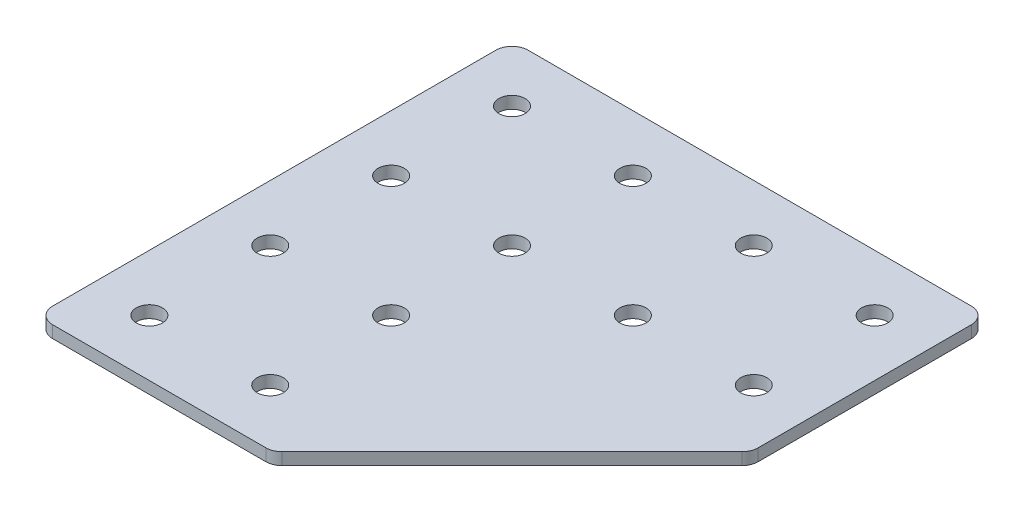
ISO-10303-21;
HEADER;
FILE_DESCRIPTION(('STEP AP214'),'2;1');
FILE_NAME('part.step','',(''),(''),'','','');
FILE_SCHEMA(('AUTOMOTIVE_DESIGN { 1 0 10303 214 1 1 1 1 }'));
ENDSEC;
DATA;
#1=APPLICATION_CONTEXT('core data for automotive mechanical design processes');
#2=APPLICATION_PROTOCOL_DEFINITION('international standard','automotive_design',2000,#1);
#3=PRODUCT_CONTEXT('',#1,'mechanical');
#4=PRODUCT('Part','Part','',(#3));
#5=PRODUCT_RELATED_PRODUCT_CATEGORY('part','',(#4));
#6=PRODUCT_DEFINITION_FORMATION('','',#4);
#7=PRODUCT_DEFINITION_CONTEXT('part definition',#1,'design');
#8=PRODUCT_DEFINITION('design','',#6,#7);
#9=PRODUCT_DEFINITION_SHAPE('','',#8);
#10=(LENGTH_UNIT() NAMED_UNIT(*) SI_UNIT(.MILLI.,.METRE.));
#11=(NAMED_UNIT(*) PLANE_ANGLE_UNIT() SI_UNIT($,.RADIAN.));
#12=(NAMED_UNIT(*) SI_UNIT($,.STERADIAN.) SOLID_ANGLE_UNIT());
#13=UNCERTAINTY_MEASURE_WITH_UNIT(LENGTH_MEASURE(1.E-05),#10,'distance_accuracy_value','');
#14=(GEOMETRIC_REPRESENTATION_CONTEXT(3) GLOBAL_UNCERTAINTY_ASSIGNED_CONTEXT((#13)) GLOBAL_UNIT_ASSIGNED_CONTEXT((#10,
#11,#12)) REPRESENTATION_CONTEXT('',''));
#15=CARTESIAN_POINT('',(0.,0.,0.));
#16=DIRECTION('',(0.,0.,1.));
#17=DIRECTION('',(1.,0.,0.));
#18=AXIS2_PLACEMENT_3D('',#15,#16,#17);
#19=CARTESIAN_POINT('',(-15.9700014306304,1.74134831022957,-16.520941998649));
#20=DIRECTION('',(0.,-1.,0.));
#21=DIRECTION('',(0.,0.,-1.));
#22=AXIS2_PLACEMENT_3D('',#19,#20,#21);
#23=PLANE('',#22);
#24=CARTESIAN_POINT('',(21.5299985693696,1.74134831022957,-9.02094199864901));
#25=DIRECTION('',(0.,1.,0.));
#26=DIRECTION('',(0.,0.,1.));
#27=AXIS2_PLACEMENT_3D('',#24,#25,#26);
#28=CIRCLE('',#27,1.625);
#29=CARTESIAN_POINT('',(21.5299985693696,1.74134831022957,-7.39594199864901));
#30=VERTEX_POINT('',#29);
#31=EDGE_CURVE('E252',#30,#30,#28,.T.);
#32=ORIENTED_EDGE('',*,*,#31,.T.);
#33=EDGE_LOOP('',(#32));
#34=FACE_BOUND('',#33,.T.);
#35=CARTESIAN_POINT('',(6.52999856936955,1.74134831022957,-9.020941998649));
#36=DIRECTION('',(0.,1.,0.));
#37=DIRECTION('',(0.,0.,1.));
#38=AXIS2_PLACEMENT_3D('',#35,#36,#37);
#39=CIRCLE('',#38,1.625);
#40=CARTESIAN_POINT('',(6.52999856936955,1.74134831022957,-7.395941998649));
#41=VERTEX_POINT('',#40);
#42=EDGE_CURVE('E246',#41,#41,#39,.T.);
#43=ORIENTED_EDGE('',*,*,#42,.T.);
#44=EDGE_LOOP('',(#43));
#45=FACE_BOUND('',#44,.T.);
#46=CARTESIAN_POINT('',(-8.47000143063042,1.74134831022957,20.979058001351));
#47=DIRECTION('',(0.,1.,0.));
#48=DIRECTION('',(0.,0.,1.));
#49=AXIS2_PLACEMENT_3D('',#46,#47,#48);
#50=CIRCLE('',#49,1.625);
#51=CARTESIAN_POINT('',(-8.47000143063042,1.74134831022957,22.604058001351));
#52=VERTEX_POINT('',#51);
#53=EDGE_CURVE('E240',#52,#52,#50,.T.);
#54=ORIENTED_EDGE('',*,*,#53,.T.);
#55=EDGE_LOOP('',(#54));
#56=FACE_BOUND('',#55,.T.);
#57=CARTESIAN_POINT('',(-23.4700014306304,1.74134831022957,20.979058001351));
#58=DIRECTION('',(0.,1.,0.));
#59=DIRECTION('',(0.,0.,1.));
#60=AXIS2_PLACEMENT_3D('',#57,#58,#59);
#61=CIRCLE('',#60,1.625);
#62=CARTESIAN_POINT('',(-23.4700014306304,1.74134831022957,22.604058001351));
#63=VERTEX_POINT('',#62);
#64=EDGE_CURVE('E234',#63,#63,#61,.T.);
#65=ORIENTED_EDGE('',*,*,#64,.T.);
#66=EDGE_LOOP('',(#65));
#67=FACE_BOUND('',#66,.T.);
#68=CARTESIAN_POINT('',(-8.47000143063041,1.74134831022957,5.97905800135099));
#69=DIRECTION('',(0.,1.,0.));
#70=DIRECTION('',(0.,0.,1.));
#71=AXIS2_PLACEMENT_3D('',#68,#69,#70);
#72=CIRCLE('',#71,1.625);
#73=CARTESIAN_POINT('',(-8.47000143063041,1.74134831022957,7.60405800135099));
#74=VERTEX_POINT('',#73);
#75=EDGE_CURVE('E228',#74,#74,#72,.T.);
#76=ORIENTED_EDGE('',*,*,#75,.T.);
#77=EDGE_LOOP('',(#76));
#78=FACE_BOUND('',#77,.T.);
#79=CARTESIAN_POINT('',(-23.4700014306304,1.74134831022957,5.97905800135099));
#80=DIRECTION('',(0.,1.,0.));
#81=DIRECTION('',(0.,0.,1.));
#82=AXIS2_PLACEMENT_3D('',#79,#80,#81);
#83=CIRCLE('',#82,1.625);
#84=CARTESIAN_POINT('',(-23.4700014306304,1.74134831022957,7.60405800135099));
#85=VERTEX_POINT('',#84);
#86=EDGE_CURVE('E222',#85,#85,#83,.T.);
#87=ORIENTED_EDGE('',*,*,#86,.T.);
#88=EDGE_LOOP('',(#87));
#89=FACE_BOUND('',#88,.T.);
#90=CARTESIAN_POINT('',(-8.47000143063044,1.74134831022957,-9.020941998649));
#91=DIRECTION('',(0.,1.,0.));
#92=DIRECTION('',(0.,0.,1.));
#93=AXIS2_PLACEMENT_3D('',#90,#91,#92);
#94=CIRCLE('',#93,1.625);
#95=CARTESIAN_POINT('',(-8.47000143063044,1.74134831022957,-7.395941998649));
#96=VERTEX_POINT('',#95);
#97=EDGE_CURVE('E216',#96,#96,#94,.T.);
#98=ORIENTED_EDGE('',*,*,#97,.T.);
#99=EDGE_LOOP('',(#98));
#100=FACE_BOUND('',#99,.T.);
#101=CARTESIAN_POINT('',(-23.4700014306304,1.74134831022957,-9.02094199864902));
#102=DIRECTION('',(0.,1.,0.));
#103=DIRECTION('',(0.,0.,1.));
#104=AXIS2_PLACEMENT_3D('',#101,#102,#103);
#105=CIRCLE('',#104,1.625);
#106=CARTESIAN_POINT('',(-23.4700014306304,1.74134831022957,-7.39594199864902));
#107=VERTEX_POINT('',#106);
#108=EDGE_CURVE('E210',#107,#107,#105,.T.);
#109=ORIENTED_EDGE('',*,*,#108,.T.);
#110=EDGE_LOOP('',(#109));
#111=FACE_BOUND('',#110,.T.);
#112=CARTESIAN_POINT('',(21.5299985693696,1.74134831022957,-24.020941998649));
#113=DIRECTION('',(0.,1.,0.));
#114=DIRECTION('',(0.,0.,1.));
#115=AXIS2_PLACEMENT_3D('',#112,#113,#114);
#116=CIRCLE('',#115,1.625);
#117=CARTESIAN_POINT('',(21.5299985693696,1.74134831022957,-22.395941998649));
#118=VERTEX_POINT('',#117);
#119=EDGE_CURVE('E204',#118,#118,#116,.T.);
#120=ORIENTED_EDGE('',*,*,#119,.T.);
#121=EDGE_LOOP('',(#120));
#122=FACE_BOUND('',#121,.T.);
#123=CARTESIAN_POINT('',(6.52999856936955,1.74134831022957,-24.020941998649));
#124=DIRECTION('',(0.,1.,0.));
#125=DIRECTION('',(0.,0.,1.));
#126=AXIS2_PLACEMENT_3D('',#123,#124,#125);
#127=CIRCLE('',#126,1.625);
#128=CARTESIAN_POINT('',(6.52999856936955,1.74134831022957,-22.395941998649));
#129=VERTEX_POINT('',#128);
#130=EDGE_CURVE('E198',#129,#129,#127,.T.);
#131=ORIENTED_EDGE('',*,*,#130,.T.);
#132=EDGE_LOOP('',(#131));
#133=FACE_BOUND('',#132,.T.);
#134=CARTESIAN_POINT('',(-8.47000143063044,1.74134831022957,-24.020941998649));
#135=DIRECTION('',(0.,1.,0.));
#136=DIRECTION('',(0.,0.,1.));
#137=AXIS2_PLACEMENT_3D('',#134,#135,#136);
#138=CIRCLE('',#137,1.625);
#139=CARTESIAN_POINT('',(-8.47000143063044,1.74134831022957,-22.395941998649));
#140=VERTEX_POINT('',#139);
#141=EDGE_CURVE('E192',#140,#140,#138,.T.);
#142=ORIENTED_EDGE('',*,*,#141,.T.);
#143=EDGE_LOOP('',(#142));
#144=FACE_BOUND('',#143,.T.);
#145=CARTESIAN_POINT('',(-23.4700014306304,1.74134831022957,-24.020941998649));
#146=DIRECTION('',(0.,1.,0.));
#147=DIRECTION('',(0.,0.,1.));
#148=AXIS2_PLACEMENT_3D('',#145,#146,#147);
#149=CIRCLE('',#148,1.625);
#150=CARTESIAN_POINT('',(-23.4700014306304,1.74134831022957,-22.395941998649));
#151=VERTEX_POINT('',#150);
#152=EDGE_CURVE('E167',#151,#151,#149,.T.);
#153=ORIENTED_EDGE('',*,*,#152,.T.);
#154=EDGE_LOOP('',(#153));
#155=FACE_BOUND('',#154,.T.);
#156=DIRECTION('',(0.707106781186548,0.,-0.707106781186547));
#157=VECTOR('',#156,1.);
#158=CARTESIAN_POINT('',(-1.17710821181696,1.74134831022957,27.9790580013509));
#159=LINE('',#158,#157);
#160=CARTESIAN_POINT('',(-0.591321774190058,1.74134831022957,27.393271563724));
#161=VERTEX_POINT('',#160);
#162=CARTESIAN_POINT('',(27.9442121317427,1.74134831022957,-1.14226234220862));
#163=VERTEX_POINT('',#162);
#164=EDGE_CURVE('E115',#161,#163,#159,.T.);
#165=ORIENTED_EDGE('',*,*,#164,.F.);
#166=CARTESIAN_POINT('',(-2.00553533656315,1.74134831022957,25.9790580013509));
#167=DIRECTION('',(0.,-1.,0.));
#168=DIRECTION('',(0.,0.,-1.));
#169=AXIS2_PLACEMENT_3D('',#166,#167,#168);
#170=CIRCLE('',#169,2.);
#171=CARTESIAN_POINT('',(-2.00553533656315,1.74134831022957,27.9790580013509));
#172=VERTEX_POINT('',#171);
#173=EDGE_CURVE('E141',#161,#172,#170,.T.);
#174=ORIENTED_EDGE('',*,*,#173,.T.);
#175=DIRECTION('',(1.,0.,0.));
#176=VECTOR('',#175,1.);
#177=CARTESIAN_POINT('',(-30.4700014306304,1.74134831022957,27.9790580013509));
#178=LINE('',#177,#176);
#179=CARTESIAN_POINT('',(-28.4700014306304,1.74134831022957,27.9790580013509));
#180=VERTEX_POINT('',#179);
#181=EDGE_CURVE('E119',#180,#172,#178,.T.);
#182=ORIENTED_EDGE('',*,*,#181,.F.);
#183=CARTESIAN_POINT('',(-28.4700014306304,1.74134831022957,25.9790580013509));
#184=DIRECTION('',(0.,-1.,0.));
#185=DIRECTION('',(0.,0.,-1.));
#186=AXIS2_PLACEMENT_3D('',#183,#184,#185);
#187=CIRCLE('',#186,2.);
#188=CARTESIAN_POINT('',(-30.4700014306304,1.74134831022957,25.9790580013509));
#189=VERTEX_POINT('',#188);
#190=EDGE_CURVE('E31',#180,#189,#187,.T.);
#191=ORIENTED_EDGE('',*,*,#190,.T.);
#192=DIRECTION('',(0.,0.,1.));
#193=VECTOR('',#192,1.);
#194=CARTESIAN_POINT('',(-30.4700014306304,1.74134831022957,-31.0209419986491));
#195=LINE('',#194,#193);
#196=CARTESIAN_POINT('',(-30.4700014306304,1.74134831022957,-29.0209419986491));
#197=VERTEX_POINT('',#196);
#198=EDGE_CURVE('E153',#197,#189,#195,.T.);
#199=ORIENTED_EDGE('',*,*,#198,.F.);
#200=CARTESIAN_POINT('',(-28.4700014306304,1.74134831022957,-29.0209419986491));
#201=DIRECTION('',(0.,-1.,0.));
#202=DIRECTION('',(0.,0.,-1.));
#203=AXIS2_PLACEMENT_3D('',#200,#201,#202);
#204=CIRCLE('',#203,2.);
#205=CARTESIAN_POINT('',(-28.4700014306304,1.74134831022957,-31.0209419986491));
#206=VERTEX_POINT('',#205);
#207=EDGE_CURVE('E137',#197,#206,#204,.T.);
#208=ORIENTED_EDGE('',*,*,#207,.T.);
#209=DIRECTION('',(-1.,0.,0.));
#210=VECTOR('',#209,1.);
#211=CARTESIAN_POINT('',(28.5299985693696,1.74134831022957,-31.0209419986491));
#212=LINE('',#211,#210);
#213=CARTESIAN_POINT('',(26.5299985693696,1.74134831022957,-31.0209419986491));
#214=VERTEX_POINT('',#213);
#215=EDGE_CURVE('E155',#214,#206,#212,.T.);
#216=ORIENTED_EDGE('',*,*,#215,.F.);
#217=CARTESIAN_POINT('',(26.5299985693696,1.74134831022957,-29.020941998649));
#218=DIRECTION('',(0.,-1.,0.));
#219=DIRECTION('',(0.,0.,-1.));
#220=AXIS2_PLACEMENT_3D('',#217,#218,#219);
#221=CIRCLE('',#220,2.);
#222=CARTESIAN_POINT('',(28.5299985693696,1.74134831022957,-29.020941998649));
#223=VERTEX_POINT('',#222);
#224=EDGE_CURVE('E134',#214,#223,#221,.T.);
#225=ORIENTED_EDGE('',*,*,#224,.T.);
#226=DIRECTION('',(0.,0.,-1.));
#227=VECTOR('',#226,1.);
#228=CARTESIAN_POINT('',(28.5299985693696,1.74134831022957,-1.72804877983552));
#229=LINE('',#228,#227);
#230=CARTESIAN_POINT('',(28.5299985693696,1.74134831022957,-2.55647590458171));
#231=VERTEX_POINT('',#230);
#232=EDGE_CURVE('E159',#231,#223,#229,.T.);
#233=ORIENTED_EDGE('',*,*,#232,.F.);
#234=CARTESIAN_POINT('',(26.5299985693696,1.74134831022957,-2.55647590458171));
#235=DIRECTION('',(0.,-1.,0.));
#236=DIRECTION('',(0.,0.,-1.));
#237=AXIS2_PLACEMENT_3D('',#234,#235,#236);
#238=CIRCLE('',#237,2.);
#239=EDGE_CURVE('E139',#231,#163,#238,.T.);
#240=ORIENTED_EDGE('',*,*,#239,.T.);
#241=EDGE_LOOP('',(#165,#174,#182,#191,#199,#208,#216,#225,#233,#240));
#242=FACE_BOUND('',#241,.T.);
#243=ADVANCED_FACE('F16',(#34,#45,#56,#67,#78,#89,#100,#111,#122,#133,#144,#155,#242),#23,.T.);
#244=CARTESIAN_POINT('',(28.5299985693696,1.74134831022957,-1.72804877983552));
#245=DIRECTION('',(1.,0.,0.));
#246=DIRECTION('',(0.,0.,-1.));
#247=AXIS2_PLACEMENT_3D('',#244,#245,#246);
#248=PLANE('',#247);
#249=DIRECTION('',(0.,0.,-1.));
#250=VECTOR('',#249,1.);
#251=CARTESIAN_POINT('',(28.5299985693696,3.24134831022957,-1.72804877983552));
#252=LINE('',#251,#250);
#253=CARTESIAN_POINT('',(28.5299985693696,3.24134831022957,-2.55647590458171));
#254=VERTEX_POINT('',#253);
#255=CARTESIAN_POINT('',(28.5299985693696,3.24134831022957,-29.020941998649));
#256=VERTEX_POINT('',#255);
#257=EDGE_CURVE('E163',#254,#256,#252,.T.);
#258=ORIENTED_EDGE('',*,*,#257,.F.);
#259=DIRECTION('',(0.,1.,0.));
#260=VECTOR('',#259,1.);
#261=CARTESIAN_POINT('',(28.5299985693696,1.74134831022957,-2.55647590458171));
#262=LINE('',#261,#260);
#263=EDGE_CURVE('E146',#254,#231,#262,.F.);
#264=ORIENTED_EDGE('',*,*,#263,.T.);
#265=ORIENTED_EDGE('',*,*,#232,.T.);
#266=DIRECTION('',(0.,1.,0.));
#267=VECTOR('',#266,1.);
#268=CARTESIAN_POINT('',(28.5299985693696,1.74134831022957,-29.020941998649));
#269=LINE('',#268,#267);
#270=EDGE_CURVE('E143',#223,#256,#269,.T.);
#271=ORIENTED_EDGE('',*,*,#270,.T.);
#272=EDGE_LOOP('',(#258,#264,#265,#271));
#273=FACE_BOUND('',#272,.T.);
#274=ADVANCED_FACE('F185',(#273),#248,.T.);
#275=CARTESIAN_POINT('',(-1.17710821181696,1.74134831022957,27.9790580013509));
#276=DIRECTION('',(0.707106781186547,0.,0.707106781186548));
#277=DIRECTION('',(0.707106781186548,0.,-0.707106781186547));
#278=AXIS2_PLACEMENT_3D('',#275,#276,#277);
#279=PLANE('',#278);
#280=DIRECTION('',(0.707106781186548,0.,-0.707106781186547));
#281=VECTOR('',#280,1.);
#282=CARTESIAN_POINT('',(-1.17710821181696,3.24134831022957,27.9790580013509));
#283=LINE('',#282,#281);
#284=CARTESIAN_POINT('',(-0.591321774190058,3.24134831022957,27.393271563724));
#285=VERTEX_POINT('',#284);
#286=CARTESIAN_POINT('',(27.9442121317427,3.24134831022957,-1.14226234220862));
#287=VERTEX_POINT('',#286);
#288=EDGE_CURVE('E112',#285,#287,#283,.T.);
#289=ORIENTED_EDGE('',*,*,#288,.F.);
#290=DIRECTION('',(0.,1.,0.));
#291=VECTOR('',#290,1.);
#292=CARTESIAN_POINT('',(-0.59132177419006,1.74134831022957,27.393271563724));
#293=LINE('',#292,#291);
#294=EDGE_CURVE('E132',#285,#161,#293,.F.);
#295=ORIENTED_EDGE('',*,*,#294,.T.);
#296=ORIENTED_EDGE('',*,*,#164,.T.);
#297=DIRECTION('',(0.,1.,0.));
#298=VECTOR('',#297,1.);
#299=CARTESIAN_POINT('',(27.9442121317427,1.74134831022957,-1.14226234220861));
#300=LINE('',#299,#298);
#301=EDGE_CURVE('E129',#163,#287,#300,.T.);
#302=ORIENTED_EDGE('',*,*,#301,.T.);
#303=EDGE_LOOP('',(#289,#295,#296,#302));
#304=FACE_BOUND('',#303,.T.);
#305=ADVANCED_FACE('F315',(#304),#279,.T.);
#306=CARTESIAN_POINT('',(-30.4700014306304,1.74134831022957,27.9790580013509));
#307=DIRECTION('',(0.,0.,1.));
#308=DIRECTION('',(1.,0.,0.));
#309=AXIS2_PLACEMENT_3D('',#306,#307,#308);
#310=PLANE('',#309);
#311=ORIENTED_EDGE('',*,*,#181,.T.);
#312=DIRECTION('',(0.,1.,0.));
#313=VECTOR('',#312,1.);
#314=CARTESIAN_POINT('',(-2.00553533656315,1.74134831022957,27.9790580013509));
#315=LINE('',#314,#313);
#316=CARTESIAN_POINT('',(-2.00553533656315,3.24134831022957,27.9790580013509));
#317=VERTEX_POINT('',#316);
#318=EDGE_CURVE('E111',#172,#317,#315,.T.);
#319=ORIENTED_EDGE('',*,*,#318,.T.);
#320=DIRECTION('',(1.,0.,0.));
#321=VECTOR('',#320,1.);
#322=CARTESIAN_POINT('',(-30.4700014306304,3.24134831022957,27.9790580013509));
#323=LINE('',#322,#321);
#324=CARTESIAN_POINT('',(-28.4700014306304,3.24134831022957,27.9790580013509));
#325=VERTEX_POINT('',#324);
#326=EDGE_CURVE('E96',#325,#317,#323,.T.);
#327=ORIENTED_EDGE('',*,*,#326,.F.);
#328=DIRECTION('',(0.,1.,0.));
#329=VECTOR('',#328,1.);
#330=CARTESIAN_POINT('',(-28.4700014306304,1.74134831022957,27.9790580013509));
#331=LINE('',#330,#329);
#332=EDGE_CURVE('E109',#325,#180,#331,.F.);
#333=ORIENTED_EDGE('',*,*,#332,.T.);
#334=EDGE_LOOP('',(#311,#319,#327,#333));
#335=FACE_BOUND('',#334,.T.);
#336=ADVANCED_FACE('F108',(#335),#310,.T.);
#337=CARTESIAN_POINT('',(-30.4700014306304,1.74134831022957,-31.0209419986491));
#338=DIRECTION('',(-1.,0.,0.));
#339=DIRECTION('',(0.,0.,1.));
#340=AXIS2_PLACEMENT_3D('',#337,#338,#339);
#341=PLANE('',#340);
#342=DIRECTION('',(0.,0.,1.));
#343=VECTOR('',#342,1.);
#344=CARTESIAN_POINT('',(-30.4700014306304,3.24134831022957,-31.0209419986491));
#345=LINE('',#344,#343);
#346=CARTESIAN_POINT('',(-30.4700014306304,3.24134831022957,-29.0209419986491));
#347=VERTEX_POINT('',#346);
#348=CARTESIAN_POINT('',(-30.4700014306304,3.24134831022957,25.9790580013509));
#349=VERTEX_POINT('',#348);
#350=EDGE_CURVE('E97',#347,#349,#345,.T.);
#351=ORIENTED_EDGE('',*,*,#350,.F.);
#352=DIRECTION('',(0.,1.,0.));
#353=VECTOR('',#352,1.);
#354=CARTESIAN_POINT('',(-30.4700014306304,1.74134831022957,-29.0209419986491));
#355=LINE('',#354,#353);
#356=EDGE_CURVE('E10',#347,#197,#355,.F.);
#357=ORIENTED_EDGE('',*,*,#356,.T.);
#358=ORIENTED_EDGE('',*,*,#198,.T.);
#359=DIRECTION('',(0.,1.,0.));
#360=VECTOR('',#359,1.);
#361=CARTESIAN_POINT('',(-30.4700014306304,1.74134831022957,25.9790580013509));
#362=LINE('',#361,#360);
#363=EDGE_CURVE('E24',#189,#349,#362,.T.);
#364=ORIENTED_EDGE('',*,*,#363,.T.);
#365=EDGE_LOOP('',(#351,#357,#358,#364));
#366=FACE_BOUND('',#365,.T.);
#367=ADVANCED_FACE('F152',(#366),#341,.T.);
#368=CARTESIAN_POINT('',(28.5299985693696,1.74134831022957,-31.0209419986491));
#369=DIRECTION('',(0.,0.,-1.));
#370=DIRECTION('',(-1.,0.,0.));
#371=AXIS2_PLACEMENT_3D('',#368,#369,#370);
#372=PLANE('',#371);
#373=ORIENTED_EDGE('',*,*,#215,.T.);
#374=DIRECTION('',(0.,1.,0.));
#375=VECTOR('',#374,1.);
#376=CARTESIAN_POINT('',(-28.4700014306304,1.74134831022957,-31.0209419986491));
#377=LINE('',#376,#375);
#378=CARTESIAN_POINT('',(-28.4700014306304,3.24134831022957,-31.0209419986491));
#379=VERTEX_POINT('',#378);
#380=EDGE_CURVE('E150',#206,#379,#377,.T.);
#381=ORIENTED_EDGE('',*,*,#380,.T.);
#382=DIRECTION('',(-1.,0.,0.));
#383=VECTOR('',#382,1.);
#384=CARTESIAN_POINT('',(28.5299985693696,3.24134831022957,-31.0209419986491));
#385=LINE('',#384,#383);
#386=CARTESIAN_POINT('',(26.5299985693696,3.24134831022957,-31.0209419986491));
#387=VERTEX_POINT('',#386);
#388=EDGE_CURVE('E166',#387,#379,#385,.T.);
#389=ORIENTED_EDGE('',*,*,#388,.F.);
#390=DIRECTION('',(0.,1.,0.));
#391=VECTOR('',#390,1.);
#392=CARTESIAN_POINT('',(26.5299985693696,1.74134831022957,-31.0209419986491));
#393=LINE('',#392,#391);
#394=EDGE_CURVE('E148',#387,#214,#393,.F.);
#395=ORIENTED_EDGE('',*,*,#394,.T.);
#396=EDGE_LOOP('',(#373,#381,#389,#395));
#397=FACE_BOUND('',#396,.T.);
#398=ADVANCED_FACE('F173',(#397),#372,.T.);
#399=CARTESIAN_POINT('',(-15.9700014306304,3.24134831022957,-16.520941998649));
#400=DIRECTION('',(0.,-1.,0.));
#401=DIRECTION('',(0.,0.,-1.));
#402=AXIS2_PLACEMENT_3D('',#399,#400,#401);
#403=PLANE('',#402);
#404=CARTESIAN_POINT('',(21.5299985693696,3.24134831022957,-9.02094199864901));
#405=DIRECTION('',(0.,1.,0.));
#406=DIRECTION('',(0.,0.,1.));
#407=AXIS2_PLACEMENT_3D('',#404,#405,#406);
#408=CIRCLE('',#407,1.625);
#409=CARTESIAN_POINT('',(21.5299985693696,3.24134831022957,-7.39594199864901));
#410=VERTEX_POINT('',#409);
#411=EDGE_CURVE('E255',#410,#410,#408,.T.);
#412=ORIENTED_EDGE('',*,*,#411,.F.);
#413=EDGE_LOOP('',(#412));
#414=FACE_BOUND('',#413,.T.);
#415=CARTESIAN_POINT('',(6.52999856936955,3.24134831022957,-9.020941998649));
#416=DIRECTION('',(0.,1.,0.));
#417=DIRECTION('',(0.,0.,1.));
#418=AXIS2_PLACEMENT_3D('',#415,#416,#417);
#419=CIRCLE('',#418,1.625);
#420=CARTESIAN_POINT('',(6.52999856936955,3.24134831022957,-7.395941998649));
#421=VERTEX_POINT('',#420);
#422=EDGE_CURVE('E249',#421,#421,#419,.T.);
#423=ORIENTED_EDGE('',*,*,#422,.F.);
#424=EDGE_LOOP('',(#423));
#425=FACE_BOUND('',#424,.T.);
#426=CARTESIAN_POINT('',(-8.47000143063042,3.24134831022957,20.979058001351));
#427=DIRECTION('',(0.,1.,0.));
#428=DIRECTION('',(0.,0.,1.));
#429=AXIS2_PLACEMENT_3D('',#426,#427,#428);
#430=CIRCLE('',#429,1.625);
#431=CARTESIAN_POINT('',(-8.47000143063042,3.24134831022957,22.604058001351));
#432=VERTEX_POINT('',#431);
#433=EDGE_CURVE('E243',#432,#432,#430,.T.);
#434=ORIENTED_EDGE('',*,*,#433,.F.);
#435=EDGE_LOOP('',(#434));
#436=FACE_BOUND('',#435,.T.);
#437=CARTESIAN_POINT('',(-23.4700014306304,3.24134831022957,20.979058001351));
#438=DIRECTION('',(0.,1.,0.));
#439=DIRECTION('',(0.,0.,1.));
#440=AXIS2_PLACEMENT_3D('',#437,#438,#439);
#441=CIRCLE('',#440,1.625);
#442=CARTESIAN_POINT('',(-23.4700014306304,3.24134831022957,22.604058001351));
#443=VERTEX_POINT('',#442);
#444=EDGE_CURVE('E237',#443,#443,#441,.T.);
#445=ORIENTED_EDGE('',*,*,#444,.F.);
#446=EDGE_LOOP('',(#445));
#447=FACE_BOUND('',#446,.T.);
#448=CARTESIAN_POINT('',(-8.47000143063041,3.24134831022957,5.97905800135099));
#449=DIRECTION('',(0.,1.,0.));
#450=DIRECTION('',(0.,0.,1.));
#451=AXIS2_PLACEMENT_3D('',#448,#449,#450);
#452=CIRCLE('',#451,1.625);
#453=CARTESIAN_POINT('',(-8.47000143063041,3.24134831022957,7.60405800135099));
#454=VERTEX_POINT('',#453);
#455=EDGE_CURVE('E231',#454,#454,#452,.T.);
#456=ORIENTED_EDGE('',*,*,#455,.F.);
#457=EDGE_LOOP('',(#456));
#458=FACE_BOUND('',#457,.T.);
#459=CARTESIAN_POINT('',(-23.4700014306304,3.24134831022957,5.97905800135099));
#460=DIRECTION('',(0.,1.,0.));
#461=DIRECTION('',(0.,0.,1.));
#462=AXIS2_PLACEMENT_3D('',#459,#460,#461);
#463=CIRCLE('',#462,1.625);
#464=CARTESIAN_POINT('',(-23.4700014306304,3.24134831022957,7.60405800135099));
#465=VERTEX_POINT('',#464);
#466=EDGE_CURVE('E225',#465,#465,#463,.T.);
#467=ORIENTED_EDGE('',*,*,#466,.F.);
#468=EDGE_LOOP('',(#467));
#469=FACE_BOUND('',#468,.T.);
#470=CARTESIAN_POINT('',(-8.47000143063044,3.24134831022957,-9.020941998649));
#471=DIRECTION('',(0.,1.,0.));
#472=DIRECTION('',(0.,0.,1.));
#473=AXIS2_PLACEMENT_3D('',#470,#471,#472);
#474=CIRCLE('',#473,1.625);
#475=CARTESIAN_POINT('',(-8.47000143063044,3.24134831022957,-7.395941998649));
#476=VERTEX_POINT('',#475);
#477=EDGE_CURVE('E219',#476,#476,#474,.T.);
#478=ORIENTED_EDGE('',*,*,#477,.F.);
#479=EDGE_LOOP('',(#478));
#480=FACE_BOUND('',#479,.T.);
#481=CARTESIAN_POINT('',(-23.4700014306304,3.24134831022957,-9.02094199864902));
#482=DIRECTION('',(0.,1.,0.));
#483=DIRECTION('',(0.,0.,1.));
#484=AXIS2_PLACEMENT_3D('',#481,#482,#483);
#485=CIRCLE('',#484,1.625);
#486=CARTESIAN_POINT('',(-23.4700014306304,3.24134831022957,-7.39594199864902));
#487=VERTEX_POINT('',#486);
#488=EDGE_CURVE('E213',#487,#487,#485,.T.);
#489=ORIENTED_EDGE('',*,*,#488,.F.);
#490=EDGE_LOOP('',(#489));
#491=FACE_BOUND('',#490,.T.);
#492=CARTESIAN_POINT('',(21.5299985693696,3.24134831022957,-24.020941998649));
#493=DIRECTION('',(0.,1.,0.));
#494=DIRECTION('',(0.,0.,1.));
#495=AXIS2_PLACEMENT_3D('',#492,#493,#494);
#496=CIRCLE('',#495,1.625);
#497=CARTESIAN_POINT('',(21.5299985693696,3.24134831022957,-22.395941998649));
#498=VERTEX_POINT('',#497);
#499=EDGE_CURVE('E207',#498,#498,#496,.T.);
#500=ORIENTED_EDGE('',*,*,#499,.F.);
#501=EDGE_LOOP('',(#500));
#502=FACE_BOUND('',#501,.T.);
#503=CARTESIAN_POINT('',(6.52999856936955,3.24134831022957,-24.020941998649));
#504=DIRECTION('',(0.,1.,0.));
#505=DIRECTION('',(0.,0.,1.));
#506=AXIS2_PLACEMENT_3D('',#503,#504,#505);
#507=CIRCLE('',#506,1.625);
#508=CARTESIAN_POINT('',(6.52999856936955,3.24134831022957,-22.395941998649));
#509=VERTEX_POINT('',#508);
#510=EDGE_CURVE('E201',#509,#509,#507,.T.);
#511=ORIENTED_EDGE('',*,*,#510,.F.);
#512=EDGE_LOOP('',(#511));
#513=FACE_BOUND('',#512,.T.);
#514=CARTESIAN_POINT('',(-8.47000143063044,3.24134831022957,-24.020941998649));
#515=DIRECTION('',(0.,1.,0.));
#516=DIRECTION('',(0.,0.,1.));
#517=AXIS2_PLACEMENT_3D('',#514,#515,#516);
#518=CIRCLE('',#517,1.625);
#519=CARTESIAN_POINT('',(-8.47000143063044,3.24134831022957,-22.395941998649));
#520=VERTEX_POINT('',#519);
#521=EDGE_CURVE('E195',#520,#520,#518,.T.);
#522=ORIENTED_EDGE('',*,*,#521,.F.);
#523=EDGE_LOOP('',(#522));
#524=FACE_BOUND('',#523,.T.);
#525=CARTESIAN_POINT('',(-23.4700014306304,3.24134831022957,-24.020941998649));
#526=DIRECTION('',(0.,1.,0.));
#527=DIRECTION('',(0.,0.,1.));
#528=AXIS2_PLACEMENT_3D('',#525,#526,#527);
#529=CIRCLE('',#528,1.625);
#530=CARTESIAN_POINT('',(-23.4700014306304,3.24134831022957,-22.395941998649));
#531=VERTEX_POINT('',#530);
#532=EDGE_CURVE('E189',#531,#531,#529,.T.);
#533=ORIENTED_EDGE('',*,*,#532,.F.);
#534=EDGE_LOOP('',(#533));
#535=FACE_BOUND('',#534,.T.);
#536=ORIENTED_EDGE('',*,*,#326,.T.);
#537=CARTESIAN_POINT('',(-2.00553533656315,3.24134831022957,25.9790580013509));
#538=DIRECTION('',(0.,-1.,0.));
#539=DIRECTION('',(0.,0.,-1.));
#540=AXIS2_PLACEMENT_3D('',#537,#538,#539);
#541=CIRCLE('',#540,2.);
#542=EDGE_CURVE('E127',#317,#285,#541,.F.);
#543=ORIENTED_EDGE('',*,*,#542,.T.);
#544=ORIENTED_EDGE('',*,*,#288,.T.);
#545=CARTESIAN_POINT('',(26.5299985693696,3.24134831022957,-2.55647590458171));
#546=DIRECTION('',(0.,-1.,0.));
#547=DIRECTION('',(0.,0.,-1.));
#548=AXIS2_PLACEMENT_3D('',#545,#546,#547);
#549=CIRCLE('',#548,2.);
#550=EDGE_CURVE('E125',#287,#254,#549,.F.);
#551=ORIENTED_EDGE('',*,*,#550,.T.);
#552=ORIENTED_EDGE('',*,*,#257,.T.);
#553=CARTESIAN_POINT('',(26.5299985693696,3.24134831022957,-29.020941998649));
#554=DIRECTION('',(0.,-1.,0.));
#555=DIRECTION('',(0.,0.,-1.));
#556=AXIS2_PLACEMENT_3D('',#553,#554,#555);
#557=CIRCLE('',#556,2.);
#558=EDGE_CURVE('E103',#256,#387,#557,.F.);
#559=ORIENTED_EDGE('',*,*,#558,.T.);
#560=ORIENTED_EDGE('',*,*,#388,.T.);
#561=CARTESIAN_POINT('',(-28.4700014306304,3.24134831022957,-29.0209419986491));
#562=DIRECTION('',(0.,-1.,0.));
#563=DIRECTION('',(0.,0.,-1.));
#564=AXIS2_PLACEMENT_3D('',#561,#562,#563);
#565=CIRCLE('',#564,2.);
#566=EDGE_CURVE('E102',#379,#347,#565,.F.);
#567=ORIENTED_EDGE('',*,*,#566,.T.);
#568=ORIENTED_EDGE('',*,*,#350,.T.);
#569=CARTESIAN_POINT('',(-28.4700014306304,3.24134831022957,25.9790580013509));
#570=DIRECTION('',(0.,-1.,0.));
#571=DIRECTION('',(0.,0.,-1.));
#572=AXIS2_PLACEMENT_3D('',#569,#570,#571);
#573=CIRCLE('',#572,2.);
#574=EDGE_CURVE('E93',#349,#325,#573,.F.);
#575=ORIENTED_EDGE('',*,*,#574,.T.);
#576=EDGE_LOOP('',(#536,#543,#544,#551,#552,#559,#560,#567,#568,#575));
#577=FACE_BOUND('',#576,.T.);
#578=ADVANCED_FACE('F95',(#414,#425,#436,#447,#458,#469,#480,#491,#502,#513,#524,#535,#577),
#403,.F.);
#579=CARTESIAN_POINT('',(-23.4700014306304,1.74134831022957,-24.020941998649));
#580=DIRECTION('',(0.,1.,0.));
#581=DIRECTION('',(0.,0.,1.));
#582=AXIS2_PLACEMENT_3D('',#579,#580,#581);
#583=CYLINDRICAL_SURFACE('',#582,1.625);
#584=ORIENTED_EDGE('',*,*,#152,.F.);
#585=EDGE_LOOP('',(#584));
#586=FACE_BOUND('',#585,.T.);
#587=ORIENTED_EDGE('',*,*,#532,.T.);
#588=EDGE_LOOP('',(#587));
#589=FACE_BOUND('',#588,.T.);
#590=ADVANCED_FACE('F273',(#586,#589),#583,.F.);
#591=CARTESIAN_POINT('',(-8.47000143063044,1.74134831022957,-24.020941998649));
#592=DIRECTION('',(0.,1.,0.));
#593=DIRECTION('',(0.,0.,1.));
#594=AXIS2_PLACEMENT_3D('',#591,#592,#593);
#595=CYLINDRICAL_SURFACE('',#594,1.625);
#596=ORIENTED_EDGE('',*,*,#141,.F.);
#597=EDGE_LOOP('',(#596));
#598=FACE_BOUND('',#597,.T.);
#599=ORIENTED_EDGE('',*,*,#521,.T.);
#600=EDGE_LOOP('',(#599));
#601=FACE_BOUND('',#600,.T.);
#602=ADVANCED_FACE('F298',(#598,#601),#595,.F.);
#603=CARTESIAN_POINT('',(6.52999856936955,1.74134831022957,-24.020941998649));
#604=DIRECTION('',(0.,1.,0.));
#605=DIRECTION('',(0.,0.,1.));
#606=AXIS2_PLACEMENT_3D('',#603,#604,#605);
#607=CYLINDRICAL_SURFACE('',#606,1.625);
#608=ORIENTED_EDGE('',*,*,#130,.F.);
#609=EDGE_LOOP('',(#608));
#610=FACE_BOUND('',#609,.T.);
#611=ORIENTED_EDGE('',*,*,#510,.T.);
#612=EDGE_LOOP('',(#611));
#613=FACE_BOUND('',#612,.T.);
#614=ADVANCED_FACE('F305',(#610,#613),#607,.F.);
#615=CARTESIAN_POINT('',(21.5299985693696,1.74134831022957,-24.020941998649));
#616=DIRECTION('',(0.,1.,0.));
#617=DIRECTION('',(0.,0.,1.));
#618=AXIS2_PLACEMENT_3D('',#615,#616,#617);
#619=CYLINDRICAL_SURFACE('',#618,1.625);
#620=ORIENTED_EDGE('',*,*,#119,.F.);
#621=EDGE_LOOP('',(#620));
#622=FACE_BOUND('',#621,.T.);
#623=ORIENTED_EDGE('',*,*,#499,.T.);
#624=EDGE_LOOP('',(#623));
#625=FACE_BOUND('',#624,.T.);
#626=ADVANCED_FACE('F436',(#622,#625),#619,.F.);
#627=CARTESIAN_POINT('',(-23.4700014306304,1.74134831022957,-9.02094199864902));
#628=DIRECTION('',(0.,1.,0.));
#629=DIRECTION('',(0.,0.,1.));
#630=AXIS2_PLACEMENT_3D('',#627,#628,#629);
#631=CYLINDRICAL_SURFACE('',#630,1.625);
#632=ORIENTED_EDGE('',*,*,#108,.F.);
#633=EDGE_LOOP('',(#632));
#634=FACE_BOUND('',#633,.T.);
#635=ORIENTED_EDGE('',*,*,#488,.T.);
#636=EDGE_LOOP('',(#635));
#637=FACE_BOUND('',#636,.T.);
#638=ADVANCED_FACE('F426',(#634,#637),#631,.F.);
#639=CARTESIAN_POINT('',(-8.47000143063044,1.74134831022957,-9.020941998649));
#640=DIRECTION('',(0.,1.,0.));
#641=DIRECTION('',(0.,0.,1.));
#642=AXIS2_PLACEMENT_3D('',#639,#640,#641);
#643=CYLINDRICAL_SURFACE('',#642,1.625);
#644=ORIENTED_EDGE('',*,*,#97,.F.);
#645=EDGE_LOOP('',(#644));
#646=FACE_BOUND('',#645,.T.);
#647=ORIENTED_EDGE('',*,*,#477,.T.);
#648=EDGE_LOOP('',(#647));
#649=FACE_BOUND('',#648,.T.);
#650=ADVANCED_FACE('F416',(#646,#649),#643,.F.);
#651=CARTESIAN_POINT('',(-23.4700014306304,1.74134831022957,5.97905800135099));
#652=DIRECTION('',(0.,1.,0.));
#653=DIRECTION('',(0.,0.,1.));
#654=AXIS2_PLACEMENT_3D('',#651,#652,#653);
#655=CYLINDRICAL_SURFACE('',#654,1.625);
#656=ORIENTED_EDGE('',*,*,#86,.F.);
#657=EDGE_LOOP('',(#656));
#658=FACE_BOUND('',#657,.T.);
#659=ORIENTED_EDGE('',*,*,#466,.T.);
#660=EDGE_LOOP('',(#659));
#661=FACE_BOUND('',#660,.T.);
#662=ADVANCED_FACE('F406',(#658,#661),#655,.F.);
#663=CARTESIAN_POINT('',(-8.47000143063041,1.74134831022957,5.97905800135099));
#664=DIRECTION('',(0.,1.,0.));
#665=DIRECTION('',(0.,0.,1.));
#666=AXIS2_PLACEMENT_3D('',#663,#664,#665);
#667=CYLINDRICAL_SURFACE('',#666,1.625);
#668=ORIENTED_EDGE('',*,*,#75,.F.);
#669=EDGE_LOOP('',(#668));
#670=FACE_BOUND('',#669,.T.);
#671=ORIENTED_EDGE('',*,*,#455,.T.);
#672=EDGE_LOOP('',(#671));
#673=FACE_BOUND('',#672,.T.);
#674=ADVANCED_FACE('F396',(#670,#673),#667,.F.);
#675=CARTESIAN_POINT('',(-23.4700014306304,1.74134831022957,20.979058001351));
#676=DIRECTION('',(0.,1.,0.));
#677=DIRECTION('',(0.,0.,1.));
#678=AXIS2_PLACEMENT_3D('',#675,#676,#677);
#679=CYLINDRICAL_SURFACE('',#678,1.625);
#680=ORIENTED_EDGE('',*,*,#64,.F.);
#681=EDGE_LOOP('',(#680));
#682=FACE_BOUND('',#681,.T.);
#683=ORIENTED_EDGE('',*,*,#444,.T.);
#684=EDGE_LOOP('',(#683));
#685=FACE_BOUND('',#684,.T.);
#686=ADVANCED_FACE('F386',(#682,#685),#679,.F.);
#687=CARTESIAN_POINT('',(-8.47000143063042,1.74134831022957,20.979058001351));
#688=DIRECTION('',(0.,1.,0.));
#689=DIRECTION('',(0.,0.,1.));
#690=AXIS2_PLACEMENT_3D('',#687,#688,#689);
#691=CYLINDRICAL_SURFACE('',#690,1.625);
#692=ORIENTED_EDGE('',*,*,#53,.F.);
#693=EDGE_LOOP('',(#692));
#694=FACE_BOUND('',#693,.T.);
#695=ORIENTED_EDGE('',*,*,#433,.T.);
#696=EDGE_LOOP('',(#695));
#697=FACE_BOUND('',#696,.T.);
#698=ADVANCED_FACE('F376',(#694,#697),#691,.F.);
#699=CARTESIAN_POINT('',(6.52999856936955,1.74134831022957,-9.020941998649));
#700=DIRECTION('',(0.,1.,0.));
#701=DIRECTION('',(0.,0.,1.));
#702=AXIS2_PLACEMENT_3D('',#699,#700,#701);
#703=CYLINDRICAL_SURFACE('',#702,1.625);
#704=ORIENTED_EDGE('',*,*,#42,.F.);
#705=EDGE_LOOP('',(#704));
#706=FACE_BOUND('',#705,.T.);
#707=ORIENTED_EDGE('',*,*,#422,.T.);
#708=EDGE_LOOP('',(#707));
#709=FACE_BOUND('',#708,.T.);
#710=ADVANCED_FACE('F267',(#706,#709),#703,.F.);
#711=CARTESIAN_POINT('',(21.5299985693696,1.74134831022957,-9.02094199864901));
#712=DIRECTION('',(0.,1.,0.));
#713=DIRECTION('',(0.,0.,1.));
#714=AXIS2_PLACEMENT_3D('',#711,#712,#713);
#715=CYLINDRICAL_SURFACE('',#714,1.625);
#716=ORIENTED_EDGE('',*,*,#31,.F.);
#717=EDGE_LOOP('',(#716));
#718=FACE_BOUND('',#717,.T.);
#719=ORIENTED_EDGE('',*,*,#411,.T.);
#720=EDGE_LOOP('',(#719));
#721=FACE_BOUND('',#720,.T.);
#722=ADVANCED_FACE('F263',(#718,#721),#715,.F.);
#723=CARTESIAN_POINT('',(-2.00553533656315,1.74134831022957,25.9790580013509));
#724=DIRECTION('',(0.,1.,0.));
#725=DIRECTION('',(0.,0.,1.));
#726=AXIS2_PLACEMENT_3D('',#723,#724,#725);
#727=CYLINDRICAL_SURFACE('',#726,2.);
#728=ORIENTED_EDGE('',*,*,#173,.F.);
#729=ORIENTED_EDGE('',*,*,#294,.F.);
#730=ORIENTED_EDGE('',*,*,#542,.F.);
#731=ORIENTED_EDGE('',*,*,#318,.F.);
#732=EDGE_LOOP('',(#728,#729,#730,#731));
#733=FACE_BOUND('',#732,.T.);
#734=ADVANCED_FACE('F266',(#733),#727,.T.);
#735=CARTESIAN_POINT('',(26.5299985693696,1.74134831022957,-2.55647590458171));
#736=DIRECTION('',(0.,1.,0.));
#737=DIRECTION('',(0.,0.,1.));
#738=AXIS2_PLACEMENT_3D('',#735,#736,#737);
#739=CYLINDRICAL_SURFACE('',#738,2.);
#740=ORIENTED_EDGE('',*,*,#239,.F.);
#741=ORIENTED_EDGE('',*,*,#263,.F.);
#742=ORIENTED_EDGE('',*,*,#550,.F.);
#743=ORIENTED_EDGE('',*,*,#301,.F.);
#744=EDGE_LOOP('',(#740,#741,#742,#743));
#745=FACE_BOUND('',#744,.T.);
#746=ADVANCED_FACE('F320',(#745),#739,.T.);
#747=CARTESIAN_POINT('',(-28.4700014306304,1.74134831022957,-29.0209419986491));
#748=DIRECTION('',(0.,1.,0.));
#749=DIRECTION('',(0.,0.,1.));
#750=AXIS2_PLACEMENT_3D('',#747,#748,#749);
#751=CYLINDRICAL_SURFACE('',#750,2.);
#752=ORIENTED_EDGE('',*,*,#207,.F.);
#753=ORIENTED_EDGE('',*,*,#356,.F.);
#754=ORIENTED_EDGE('',*,*,#566,.F.);
#755=ORIENTED_EDGE('',*,*,#380,.F.);
#756=EDGE_LOOP('',(#752,#753,#754,#755));
#757=FACE_BOUND('',#756,.T.);
#758=ADVANCED_FACE('F324',(#757),#751,.T.);
#759=CARTESIAN_POINT('',(-28.4700014306304,1.74134831022957,25.9790580013509));
#760=DIRECTION('',(0.,1.,0.));
#761=DIRECTION('',(0.,0.,1.));
#762=AXIS2_PLACEMENT_3D('',#759,#760,#761);
#763=CYLINDRICAL_SURFACE('',#762,2.);
#764=ORIENTED_EDGE('',*,*,#190,.F.);
#765=ORIENTED_EDGE('',*,*,#332,.F.);
#766=ORIENTED_EDGE('',*,*,#574,.F.);
#767=ORIENTED_EDGE('',*,*,#363,.F.);
#768=EDGE_LOOP('',(#764,#765,#766,#767));
#769=FACE_BOUND('',#768,.T.);
#770=ADVANCED_FACE('F114',(#769),#763,.T.);
#771=CARTESIAN_POINT('',(26.5299985693696,1.74134831022957,-29.020941998649));
#772=DIRECTION('',(0.,1.,0.));
#773=DIRECTION('',(0.,0.,1.));
#774=AXIS2_PLACEMENT_3D('',#771,#772,#773);
#775=CYLINDRICAL_SURFACE('',#774,2.);
#776=ORIENTED_EDGE('',*,*,#224,.F.);
#777=ORIENTED_EDGE('',*,*,#394,.F.);
#778=ORIENTED_EDGE('',*,*,#558,.F.);
#779=ORIENTED_EDGE('',*,*,#270,.F.);
#780=EDGE_LOOP('',(#776,#777,#778,#779));
#781=FACE_BOUND('',#780,.T.);
#782=ADVANCED_FACE('F18',(#781),#775,.T.);
#783=CLOSED_SHELL('',(#243,#274,#305,#336,#367,#398,#578,#590,#602,#614,#626,#638,#650,#662,
#674,#686,#698,#710,#722,#734,#746,#758,#770,#782));
#784=MANIFOLD_SOLID_BREP('B1',#783);
#785=ADVANCED_BREP_SHAPE_REPRESENTATION('',(#18,#784),#14);
#786=SHAPE_DEFINITION_REPRESENTATION(#9,#785);
ENDSEC;
END-ISO-10303-21;
